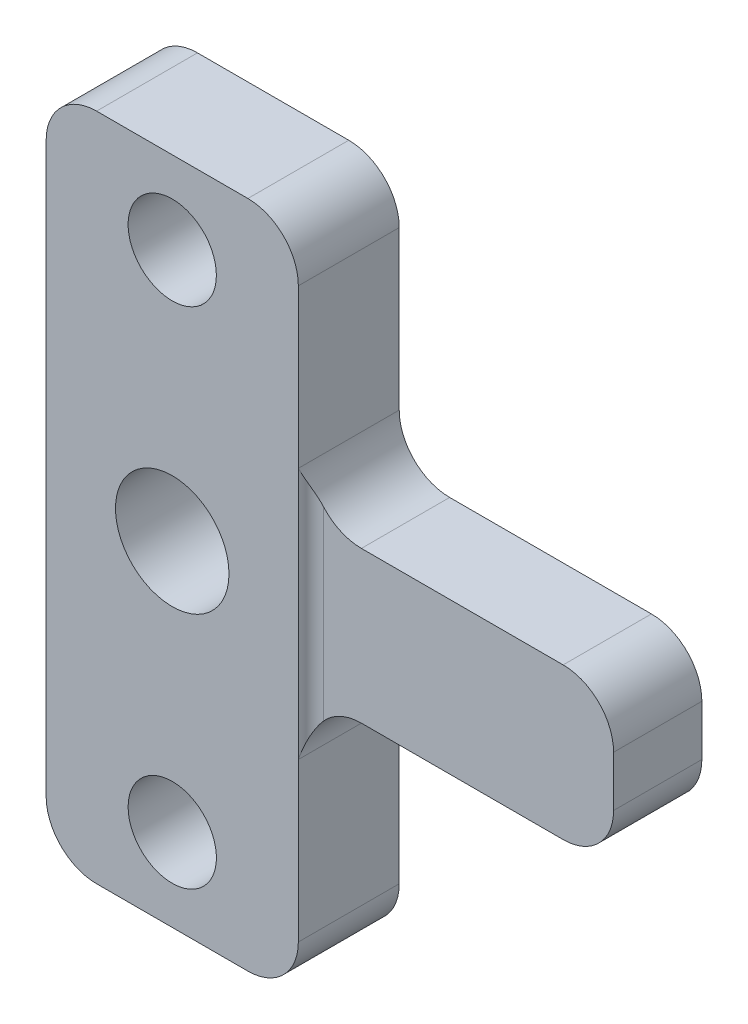
ISO-10303-21;
HEADER;
FILE_DESCRIPTION(('STEP AP214'),'2;1');
FILE_NAME('part.step','',(''),(''),'','','');
FILE_SCHEMA(('AUTOMOTIVE_DESIGN { 1 0 10303 214 1 1 1 1 }'));
ENDSEC;
DATA;
#1=APPLICATION_CONTEXT('core data for automotive mechanical design processes');
#2=APPLICATION_PROTOCOL_DEFINITION('international standard','automotive_design',2000,#1);
#3=PRODUCT_CONTEXT('',#1,'mechanical');
#4=PRODUCT('Part','Part','',(#3));
#5=PRODUCT_RELATED_PRODUCT_CATEGORY('part','',(#4));
#6=PRODUCT_DEFINITION_FORMATION('','',#4);
#7=PRODUCT_DEFINITION_CONTEXT('part definition',#1,'design');
#8=PRODUCT_DEFINITION('design','',#6,#7);
#9=PRODUCT_DEFINITION_SHAPE('','',#8);
#10=(LENGTH_UNIT() NAMED_UNIT(*) SI_UNIT(.MILLI.,.METRE.));
#11=(NAMED_UNIT(*) PLANE_ANGLE_UNIT() SI_UNIT($,.RADIAN.));
#12=(NAMED_UNIT(*) SI_UNIT($,.STERADIAN.) SOLID_ANGLE_UNIT());
#13=UNCERTAINTY_MEASURE_WITH_UNIT(LENGTH_MEASURE(1.E-05),#10,'distance_accuracy_value','');
#14=(GEOMETRIC_REPRESENTATION_CONTEXT(3) GLOBAL_UNCERTAINTY_ASSIGNED_CONTEXT((#13)) GLOBAL_UNIT_ASSIGNED_CONTEXT((#10,
#11,#12)) REPRESENTATION_CONTEXT('',''));
#15=CARTESIAN_POINT('',(0.,0.,0.));
#16=DIRECTION('',(0.,0.,1.));
#17=DIRECTION('',(1.,0.,0.));
#18=AXIS2_PLACEMENT_3D('',#15,#16,#17);
#19=CARTESIAN_POINT('',(43.5,0.,4.));
#20=DIRECTION('',(0.,1.,0.));
#21=DIRECTION('',(-1.,0.,0.));
#22=AXIS2_PLACEMENT_3D('',#19,#20,#21);
#23=CYLINDRICAL_SURFACE('',#22,0.5);
#24=DIRECTION('',(0.,-1.,0.));
#25=VECTOR('',#24,1.);
#26=CARTESIAN_POINT('',(43.5,0.,3.5));
#27=LINE('',#26,#25);
#28=CARTESIAN_POINT('',(43.5,3.6771243444677,3.5));
#29=VERTEX_POINT('',#28);
#30=CARTESIAN_POINT('',(43.5,-3.67712434446772,3.5));
#31=VERTEX_POINT('',#30);
#32=EDGE_CURVE('E261',#29,#31,#27,.T.);
#33=ORIENTED_EDGE('',*,*,#32,.F.);
#34=CARTESIAN_POINT('',(43.5,3.6771243444677,3.5));
#35=CARTESIAN_POINT('',(43.478456447429,3.70154724580707,3.50001041146748));
#36=CARTESIAN_POINT('',(43.4575425858173,3.72646938363218,3.50139028328963));
#37=CARTESIAN_POINT('',(43.417098009736,3.77710745334594,3.5064983243941));
#38=CARTESIAN_POINT('',(43.397564719702,3.80282177131216,3.51022198524381));
#39=CARTESIAN_POINT('',(43.3414150034293,3.88055504003525,3.52425533247648));
#40=CARTESIAN_POINT('',(43.3068866264115,3.93357719270997,3.53744074350752));
#41=CARTESIAN_POINT('',(43.2506386728912,4.02937730299059,3.56574389704177));
#42=CARTESIAN_POINT('',(43.2277749505332,4.07182850550373,3.57978997791444));
#43=CARTESIAN_POINT('',(43.1854730364308,4.15751907346779,3.61044334270584));
#44=CARTESIAN_POINT('',(43.1660362607877,4.20075875663314,3.6270516801234));
#45=CARTESIAN_POINT('',(43.1125802028338,4.33174102610251,3.67994999938824));
#46=CARTESIAN_POINT('',(43.083621786334,4.42038913114452,3.71919775960539));
#47=CARTESIAN_POINT('',(43.0408438347057,4.5894983929953,3.7976213981519));
#48=CARTESIAN_POINT('',(43.025763474722,4.6698526292856,3.8363806074269));
#49=CARTESIAN_POINT('',(43.0055240776471,4.83082622741695,3.91543353741805));
#50=CARTESIAN_POINT('',(43.0003381027166,4.91144426909452,3.95572278625684));
#51=CARTESIAN_POINT('',(43.0000053371165,4.99466673224143,3.99733336930474));
#52=CARTESIAN_POINT('',(43.0000000044267,4.99733340577314,3.99866670626964));
#53=CARTESIAN_POINT('',(43.,5.,4.));
#54=B_SPLINE_CURVE_WITH_KNOTS('',3,(#34,#35,#36,#37,#38,#39,#40,#41,#42,#43,#44,#45,#46,#47,#48,
#49,#50,#51,#52,#53),.UNSPECIFIED.,.F.,.F.,(4,2,2,2,2,2,2,2,2,4),(0.,0.0975966634311048,
0.195006164580395,0.388196470326693,0.538676093841842,0.68921775435282,0.991572844675024,
1.26249642313566,1.53268134341627,1.54162562963826),.UNSPECIFIED.);
#55=CARTESIAN_POINT('',(43.,5.,4.));
#56=VERTEX_POINT('',#55);
#57=EDGE_CURVE('E264',#29,#56,#54,.T.);
#58=ORIENTED_EDGE('',*,*,#57,.T.);
#59=DIRECTION('',(0.,1.,0.));
#60=VECTOR('',#59,1.);
#61=CARTESIAN_POINT('',(43.,13.2664991614216,4.));
#62=LINE('',#61,#60);
#63=CARTESIAN_POINT('',(43.,-5.,4.));
#64=VERTEX_POINT('',#63);
#65=EDGE_CURVE('E212',#64,#56,#62,.T.);
#66=ORIENTED_EDGE('',*,*,#65,.F.);
#67=CARTESIAN_POINT('',(43.5,-3.67712434446772,3.5));
#68=CARTESIAN_POINT('',(43.478456447429,-3.70154724580711,3.50001041146748));
#69=CARTESIAN_POINT('',(43.4575425858172,-3.72646938363223,3.50139028328964));
#70=CARTESIAN_POINT('',(43.4170980097359,-3.77710745334604,3.50649832439411));
#71=CARTESIAN_POINT('',(43.3975647197019,-3.80282177131229,3.51022198524383));
#72=CARTESIAN_POINT('',(43.3414150034293,-3.88055504003536,3.52425533247651));
#73=CARTESIAN_POINT('',(43.3068866264114,-3.93357719271003,3.53744074350754));
#74=CARTESIAN_POINT('',(43.2506386728912,-4.02937730299058,3.56574389704176));
#75=CARTESIAN_POINT('',(43.2277749505333,-4.07182850550372,3.57978997791442));
#76=CARTESIAN_POINT('',(43.1854730364309,-4.15751907346773,3.61044334270582));
#77=CARTESIAN_POINT('',(43.1660362607877,-4.20075875663306,3.6270516801234));
#78=CARTESIAN_POINT('',(43.1125802028338,-4.3317410261025,3.67994999938815));
#79=CARTESIAN_POINT('',(43.083621786334,-4.4203891311447,3.719197759605));
#80=CARTESIAN_POINT('',(43.0408438347057,-4.58949839299516,3.79762139815224));
#81=CARTESIAN_POINT('',(43.025763474722,-4.66985262928502,3.83638060742814));
#82=CARTESIAN_POINT('',(43.0055240776472,-4.8308262274176,3.91543353741682));
#83=CARTESIAN_POINT('',(43.0003381027167,-4.91144426909683,3.95572278625225));
#84=CARTESIAN_POINT('',(43.0000053371165,-4.99466673224158,3.99733336930443));
#85=CARTESIAN_POINT('',(43.0000000044267,-4.99733340577322,3.99866670626949));
#86=CARTESIAN_POINT('',(43.,-5.,4.));
#87=B_SPLINE_CURVE_WITH_KNOTS('',3,(#67,#68,#69,#70,#71,#72,#73,#74,#75,#76,#77,#78,#79,#80,#81,
#82,#83,#84,#85,#86),.UNSPECIFIED.,.F.,.F.,(4,2,2,2,2,2,2,2,2,4),(0.,0.0975966634311902,
0.195006164580567,0.388196470326694,0.538676093841775,0.689217754352708,0.991572844675035,
1.26249642313569,1.53268134341626,1.54162562963825),.UNSPECIFIED.);
#88=EDGE_CURVE('E273',#64,#31,#87,.F.);
#89=ORIENTED_EDGE('',*,*,#88,.T.);
#90=EDGE_LOOP('',(#33,#58,#66,#89));
#91=FACE_BOUND('',#90,.T.);
#92=ADVANCED_FACE('F33',(#91),#23,.F.);
#93=CARTESIAN_POINT('',(43.,13.2664991614216,4.));
#94=DIRECTION('',(-1.,0.,0.));
#95=DIRECTION('',(0.,-1.,0.));
#96=AXIS2_PLACEMENT_3D('',#93,#94,#95);
#97=PLANE('',#96);
#98=DIRECTION('',(0.,1.,0.));
#99=VECTOR('',#98,1.);
#100=CARTESIAN_POINT('',(43.,13.2664991614216,0.));
#101=LINE('',#100,#99);
#102=CARTESIAN_POINT('',(43.,5.,0.));
#103=VERTEX_POINT('',#102);
#104=CARTESIAN_POINT('',(43.,11.2664991614216,0.));
#105=VERTEX_POINT('',#104);
#106=EDGE_CURVE('E206',#103,#105,#101,.T.);
#107=ORIENTED_EDGE('',*,*,#106,.T.);
#108=DIRECTION('',(0.,0.,-1.));
#109=VECTOR('',#108,1.);
#110=CARTESIAN_POINT('',(43.,11.2664991614216,4.));
#111=LINE('',#110,#109);
#112=CARTESIAN_POINT('',(43.,11.2664991614216,4.));
#113=VERTEX_POINT('',#112);
#114=EDGE_CURVE('E11',#105,#113,#111,.F.);
#115=ORIENTED_EDGE('',*,*,#114,.T.);
#116=EDGE_CURVE('E213',#56,#113,#62,.T.);
#117=ORIENTED_EDGE('',*,*,#116,.F.);
#118=DIRECTION('',(0.,0.,-1.));
#119=VECTOR('',#118,1.);
#120=CARTESIAN_POINT('',(43.,5.,0.));
#121=LINE('',#120,#119);
#122=EDGE_CURVE('E243',#56,#103,#121,.T.);
#123=ORIENTED_EDGE('',*,*,#122,.T.);
#124=EDGE_LOOP('',(#107,#115,#117,#123));
#125=FACE_BOUND('',#124,.T.);
#126=ADVANCED_FACE('F303',(#125),#97,.F.);
#127=CARTESIAN_POINT('',(43.,-11.2664991614216,4.));
#128=VERTEX_POINT('',#127);
#129=EDGE_CURVE('E209',#128,#64,#62,.T.);
#130=ORIENTED_EDGE('',*,*,#129,.F.);
#131=DIRECTION('',(0.,0.,-1.));
#132=VECTOR('',#131,1.);
#133=CARTESIAN_POINT('',(43.,-11.2664991614216,4.));
#134=LINE('',#133,#132);
#135=CARTESIAN_POINT('',(43.,-11.2664991614216,0.));
#136=VERTEX_POINT('',#135);
#137=EDGE_CURVE('E374',#128,#136,#134,.T.);
#138=ORIENTED_EDGE('',*,*,#137,.T.);
#139=CARTESIAN_POINT('',(43.,-5.,0.));
#140=VERTEX_POINT('',#139);
#141=EDGE_CURVE('E220',#136,#140,#101,.T.);
#142=ORIENTED_EDGE('',*,*,#141,.T.);
#143=DIRECTION('',(0.,0.,-1.));
#144=VECTOR('',#143,1.);
#145=CARTESIAN_POINT('',(43.,-5.00000000000001,3.5));
#146=LINE('',#145,#144);
#147=EDGE_CURVE('E246',#140,#64,#146,.F.);
#148=ORIENTED_EDGE('',*,*,#147,.T.);
#149=EDGE_LOOP('',(#130,#138,#142,#148));
#150=FACE_BOUND('',#149,.T.);
#151=ADVANCED_FACE('F299',(#150),#97,.F.);
#152=CARTESIAN_POINT('',(0.,0.,4.));
#153=DIRECTION('',(0.,0.,1.));
#154=DIRECTION('',(1.,0.,0.));
#155=AXIS2_PLACEMENT_3D('',#152,#153,#154);
#156=PLANE('',#155);
#157=CARTESIAN_POINT('',(38.,10.,4.));
#158=DIRECTION('',(0.,0.,1.));
#159=DIRECTION('',(1.,0.,0.));
#160=AXIS2_PLACEMENT_3D('',#157,#158,#159);
#161=CIRCLE('',#160,1.75);
#162=CARTESIAN_POINT('',(39.75,10.,4.));
#163=VERTEX_POINT('',#162);
#164=EDGE_CURVE('E197',#163,#163,#161,.T.);
#165=ORIENTED_EDGE('',*,*,#164,.F.);
#166=EDGE_LOOP('',(#165));
#167=FACE_BOUND('',#166,.T.);
#168=DIRECTION('',(1.,0.,0.));
#169=VECTOR('',#168,1.);
#170=CARTESIAN_POINT('',(33.,-13.2664991614216,4.));
#171=LINE('',#170,#169);
#172=CARTESIAN_POINT('',(35.,-13.2664991614216,4.));
#173=VERTEX_POINT('',#172);
#174=CARTESIAN_POINT('',(41.,-13.2664991614216,4.));
#175=VERTEX_POINT('',#174);
#176=EDGE_CURVE('E217',#173,#175,#171,.T.);
#177=ORIENTED_EDGE('',*,*,#176,.T.);
#178=CARTESIAN_POINT('',(41.,-11.2664991614216,4.));
#179=DIRECTION('',(0.,0.,1.));
#180=DIRECTION('',(1.,0.,0.));
#181=AXIS2_PLACEMENT_3D('',#178,#179,#180);
#182=CIRCLE('',#181,2.);
#183=EDGE_CURVE('E393',#175,#128,#182,.T.);
#184=ORIENTED_EDGE('',*,*,#183,.T.);
#185=ORIENTED_EDGE('',*,*,#129,.T.);
#186=ORIENTED_EDGE('',*,*,#65,.T.);
#187=ORIENTED_EDGE('',*,*,#116,.T.);
#188=CARTESIAN_POINT('',(41.,11.2664991614216,4.));
#189=DIRECTION('',(0.,0.,1.));
#190=DIRECTION('',(1.,0.,0.));
#191=AXIS2_PLACEMENT_3D('',#188,#189,#190);
#192=CIRCLE('',#191,2.);
#193=CARTESIAN_POINT('',(41.,13.2664991614216,4.));
#194=VERTEX_POINT('',#193);
#195=EDGE_CURVE('E388',#113,#194,#192,.T.);
#196=ORIENTED_EDGE('',*,*,#195,.T.);
#197=DIRECTION('',(-1.,0.,0.));
#198=VECTOR('',#197,1.);
#199=CARTESIAN_POINT('',(33.,13.2664991614216,4.));
#200=LINE('',#199,#198);
#201=CARTESIAN_POINT('',(35.,13.2664991614216,4.));
#202=VERTEX_POINT('',#201);
#203=EDGE_CURVE('E211',#194,#202,#200,.T.);
#204=ORIENTED_EDGE('',*,*,#203,.T.);
#205=CARTESIAN_POINT('',(35.,11.2664991614216,4.));
#206=DIRECTION('',(0.,0.,1.));
#207=DIRECTION('',(1.,0.,0.));
#208=AXIS2_PLACEMENT_3D('',#205,#206,#207);
#209=CIRCLE('',#208,2.);
#210=CARTESIAN_POINT('',(33.,11.2664991614216,4.));
#211=VERTEX_POINT('',#210);
#212=EDGE_CURVE('E55',#202,#211,#209,.T.);
#213=ORIENTED_EDGE('',*,*,#212,.T.);
#214=DIRECTION('',(0.,-1.,0.));
#215=VECTOR('',#214,1.);
#216=CARTESIAN_POINT('',(33.,13.2664991614216,4.));
#217=LINE('',#216,#215);
#218=CARTESIAN_POINT('',(33.,-11.2664991614216,4.));
#219=VERTEX_POINT('',#218);
#220=EDGE_CURVE('E215',#211,#219,#217,.T.);
#221=ORIENTED_EDGE('',*,*,#220,.T.);
#222=CARTESIAN_POINT('',(35.,-11.2664991614216,4.));
#223=DIRECTION('',(0.,0.,1.));
#224=DIRECTION('',(1.,0.,0.));
#225=AXIS2_PLACEMENT_3D('',#222,#223,#224);
#226=CIRCLE('',#225,2.);
#227=EDGE_CURVE('E391',#219,#173,#226,.T.);
#228=ORIENTED_EDGE('',*,*,#227,.T.);
#229=EDGE_LOOP('',(#177,#184,#185,#186,#187,#196,#204,#213,#221,#228));
#230=FACE_BOUND('',#229,.T.);
#231=CARTESIAN_POINT('',(38.,0.,4.));
#232=DIRECTION('',(0.,0.,1.));
#233=DIRECTION('',(1.,0.,0.));
#234=AXIS2_PLACEMENT_3D('',#231,#232,#233);
#235=CIRCLE('',#234,2.25);
#236=CARTESIAN_POINT('',(40.25,0.,4.));
#237=VERTEX_POINT('',#236);
#238=EDGE_CURVE('E203',#237,#237,#235,.T.);
#239=ORIENTED_EDGE('',*,*,#238,.F.);
#240=EDGE_LOOP('',(#239));
#241=FACE_BOUND('',#240,.T.);
#242=CARTESIAN_POINT('',(38.,-10.,4.));
#243=DIRECTION('',(0.,0.,1.));
#244=DIRECTION('',(-1.,0.,0.));
#245=AXIS2_PLACEMENT_3D('',#242,#243,#244);
#246=CIRCLE('',#245,1.75);
#247=CARTESIAN_POINT('',(36.25,-10.,4.));
#248=VERTEX_POINT('',#247);
#249=EDGE_CURVE('E190',#248,#248,#246,.T.);
#250=ORIENTED_EDGE('',*,*,#249,.F.);
#251=EDGE_LOOP('',(#250));
#252=FACE_BOUND('',#251,.T.);
#253=ADVANCED_FACE('F302',(#167,#230,#241,#252),#156,.T.);
#254=CARTESIAN_POINT('',(0.,0.,0.));
#255=DIRECTION('',(0.,0.,1.));
#256=DIRECTION('',(1.,0.,0.));
#257=AXIS2_PLACEMENT_3D('',#254,#255,#256);
#258=PLANE('',#257);
#259=ORIENTED_EDGE('',*,*,#141,.F.);
#260=CARTESIAN_POINT('',(41.,-11.2664991614216,0.));
#261=DIRECTION('',(0.,0.,1.));
#262=DIRECTION('',(1.,0.,0.));
#263=AXIS2_PLACEMENT_3D('',#260,#261,#262);
#264=CIRCLE('',#263,2.);
#265=CARTESIAN_POINT('',(41.,-13.2664991614216,0.));
#266=VERTEX_POINT('',#265);
#267=EDGE_CURVE('E381',#136,#266,#264,.F.);
#268=ORIENTED_EDGE('',*,*,#267,.T.);
#269=DIRECTION('',(1.,0.,0.));
#270=VECTOR('',#269,1.);
#271=CARTESIAN_POINT('',(33.,-13.2664991614216,0.));
#272=LINE('',#271,#270);
#273=CARTESIAN_POINT('',(35.,-13.2664991614216,0.));
#274=VERTEX_POINT('',#273);
#275=EDGE_CURVE('E227',#274,#266,#272,.T.);
#276=ORIENTED_EDGE('',*,*,#275,.F.);
#277=CARTESIAN_POINT('',(35.,-11.2664991614216,0.));
#278=DIRECTION('',(0.,0.,1.));
#279=DIRECTION('',(1.,0.,0.));
#280=AXIS2_PLACEMENT_3D('',#277,#278,#279);
#281=CIRCLE('',#280,2.);
#282=CARTESIAN_POINT('',(33.,-11.2664991614216,0.));
#283=VERTEX_POINT('',#282);
#284=EDGE_CURVE('E376',#274,#283,#281,.F.);
#285=ORIENTED_EDGE('',*,*,#284,.T.);
#286=DIRECTION('',(0.,-1.,0.));
#287=VECTOR('',#286,1.);
#288=CARTESIAN_POINT('',(33.,13.2664991614216,0.));
#289=LINE('',#288,#287);
#290=CARTESIAN_POINT('',(33.,11.2664991614216,0.));
#291=VERTEX_POINT('',#290);
#292=EDGE_CURVE('E225',#291,#283,#289,.T.);
#293=ORIENTED_EDGE('',*,*,#292,.F.);
#294=CARTESIAN_POINT('',(35.,11.2664991614216,0.));
#295=DIRECTION('',(0.,0.,1.));
#296=DIRECTION('',(1.,0.,0.));
#297=AXIS2_PLACEMENT_3D('',#294,#295,#296);
#298=CIRCLE('',#297,2.);
#299=CARTESIAN_POINT('',(35.,13.2664991614216,0.));
#300=VERTEX_POINT('',#299);
#301=EDGE_CURVE('E373',#291,#300,#298,.F.);
#302=ORIENTED_EDGE('',*,*,#301,.T.);
#303=DIRECTION('',(-1.,0.,0.));
#304=VECTOR('',#303,1.);
#305=CARTESIAN_POINT('',(33.,13.2664991614216,0.));
#306=LINE('',#305,#304);
#307=CARTESIAN_POINT('',(41.,13.2664991614216,0.));
#308=VERTEX_POINT('',#307);
#309=EDGE_CURVE('E222',#308,#300,#306,.T.);
#310=ORIENTED_EDGE('',*,*,#309,.F.);
#311=CARTESIAN_POINT('',(41.,11.2664991614216,0.));
#312=DIRECTION('',(0.,0.,1.));
#313=DIRECTION('',(1.,0.,0.));
#314=AXIS2_PLACEMENT_3D('',#311,#312,#313);
#315=CIRCLE('',#314,2.);
#316=EDGE_CURVE('E369',#308,#105,#315,.F.);
#317=ORIENTED_EDGE('',*,*,#316,.T.);
#318=ORIENTED_EDGE('',*,*,#106,.F.);
#319=CARTESIAN_POINT('',(45.,5.,0.));
#320=DIRECTION('',(0.,0.,1.));
#321=DIRECTION('',(1.,0.,0.));
#322=AXIS2_PLACEMENT_3D('',#319,#320,#321);
#323=CIRCLE('',#322,2.);
#324=CARTESIAN_POINT('',(45.,3.,0.));
#325=VERTEX_POINT('',#324);
#326=EDGE_CURVE('E256',#103,#325,#323,.T.);
#327=ORIENTED_EDGE('',*,*,#326,.T.);
#328=DIRECTION('',(-1.,0.,0.));
#329=VECTOR('',#328,1.);
#330=CARTESIAN_POINT('',(55.,3.,0.));
#331=LINE('',#330,#329);
#332=CARTESIAN_POINT('',(53.,3.,0.));
#333=VERTEX_POINT('',#332);
#334=EDGE_CURVE('E180',#333,#325,#331,.T.);
#335=ORIENTED_EDGE('',*,*,#334,.F.);
#336=CARTESIAN_POINT('',(53.,1.,0.));
#337=DIRECTION('',(0.,0.,1.));
#338=DIRECTION('',(1.,0.,0.));
#339=AXIS2_PLACEMENT_3D('',#336,#337,#338);
#340=CIRCLE('',#339,2.);
#341=CARTESIAN_POINT('',(55.,1.,0.));
#342=VERTEX_POINT('',#341);
#343=EDGE_CURVE('E164',#333,#342,#340,.F.);
#344=ORIENTED_EDGE('',*,*,#343,.T.);
#345=DIRECTION('',(0.,1.,0.));
#346=VECTOR('',#345,1.);
#347=CARTESIAN_POINT('',(55.,3.,0.));
#348=LINE('',#347,#346);
#349=CARTESIAN_POINT('',(55.,-1.,0.));
#350=VERTEX_POINT('',#349);
#351=EDGE_CURVE('E170',#350,#342,#348,.T.);
#352=ORIENTED_EDGE('',*,*,#351,.F.);
#353=CARTESIAN_POINT('',(53.,-1.,0.));
#354=DIRECTION('',(0.,0.,1.));
#355=DIRECTION('',(1.,0.,0.));
#356=AXIS2_PLACEMENT_3D('',#353,#354,#355);
#357=CIRCLE('',#356,2.);
#358=CARTESIAN_POINT('',(53.,-3.,0.));
#359=VERTEX_POINT('',#358);
#360=EDGE_CURVE('E154',#350,#359,#357,.F.);
#361=ORIENTED_EDGE('',*,*,#360,.T.);
#362=DIRECTION('',(1.,0.,0.));
#363=VECTOR('',#362,1.);
#364=CARTESIAN_POINT('',(55.,-3.,0.));
#365=LINE('',#364,#363);
#366=CARTESIAN_POINT('',(45.,-3.00000000000001,0.));
#367=VERTEX_POINT('',#366);
#368=EDGE_CURVE('E183',#367,#359,#365,.T.);
#369=ORIENTED_EDGE('',*,*,#368,.F.);
#370=CARTESIAN_POINT('',(45.,-5.,0.));
#371=DIRECTION('',(0.,0.,1.));
#372=DIRECTION('',(1.,0.,0.));
#373=AXIS2_PLACEMENT_3D('',#370,#371,#372);
#374=CIRCLE('',#373,2.);
#375=EDGE_CURVE('E251',#367,#140,#374,.T.);
#376=ORIENTED_EDGE('',*,*,#375,.T.);
#377=EDGE_LOOP('',(#259,#268,#276,#285,#293,#302,#310,#317,#318,#327,#335,#344,#352,#361,#369,#376));
#378=FACE_BOUND('',#377,.T.);
#379=CARTESIAN_POINT('',(38.,0.,0.));
#380=DIRECTION('',(0.,0.,1.));
#381=DIRECTION('',(1.,0.,0.));
#382=AXIS2_PLACEMENT_3D('',#379,#380,#381);
#383=CIRCLE('',#382,2.25);
#384=CARTESIAN_POINT('',(40.25,0.,0.));
#385=VERTEX_POINT('',#384);
#386=EDGE_CURVE('E200',#385,#385,#383,.T.);
#387=ORIENTED_EDGE('',*,*,#386,.T.);
#388=EDGE_LOOP('',(#387));
#389=FACE_BOUND('',#388,.T.);
#390=CARTESIAN_POINT('',(38.,10.,0.));
#391=DIRECTION('',(0.,0.,1.));
#392=DIRECTION('',(1.,0.,0.));
#393=AXIS2_PLACEMENT_3D('',#390,#391,#392);
#394=CIRCLE('',#393,1.75);
#395=CARTESIAN_POINT('',(39.75,10.,0.));
#396=VERTEX_POINT('',#395);
#397=EDGE_CURVE('E193',#396,#396,#394,.T.);
#398=ORIENTED_EDGE('',*,*,#397,.T.);
#399=EDGE_LOOP('',(#398));
#400=FACE_BOUND('',#399,.T.);
#401=CARTESIAN_POINT('',(38.,-10.,0.));
#402=DIRECTION('',(0.,0.,1.));
#403=DIRECTION('',(-1.,0.,0.));
#404=AXIS2_PLACEMENT_3D('',#401,#402,#403);
#405=CIRCLE('',#404,1.75);
#406=CARTESIAN_POINT('',(36.25,-10.,0.));
#407=VERTEX_POINT('',#406);
#408=EDGE_CURVE('E194',#407,#407,#405,.T.);
#409=ORIENTED_EDGE('',*,*,#408,.T.);
#410=EDGE_LOOP('',(#409));
#411=FACE_BOUND('',#410,.T.);
#412=ADVANCED_FACE('F177',(#378,#389,#400,#411),#258,.F.);
#413=CARTESIAN_POINT('',(33.,13.2664991614216,4.));
#414=DIRECTION('',(0.,-1.,0.));
#415=DIRECTION('',(1.,0.,0.));
#416=AXIS2_PLACEMENT_3D('',#413,#414,#415);
#417=PLANE('',#416);
#418=ORIENTED_EDGE('',*,*,#309,.T.);
#419=DIRECTION('',(0.,0.,-1.));
#420=VECTOR('',#419,1.);
#421=CARTESIAN_POINT('',(35.,13.2664991614216,4.));
#422=LINE('',#421,#420);
#423=EDGE_CURVE('E41',#300,#202,#422,.F.);
#424=ORIENTED_EDGE('',*,*,#423,.T.);
#425=ORIENTED_EDGE('',*,*,#203,.F.);
#426=DIRECTION('',(0.,0.,-1.));
#427=VECTOR('',#426,1.);
#428=CARTESIAN_POINT('',(41.,13.2664991614216,4.));
#429=LINE('',#428,#427);
#430=EDGE_CURVE('E399',#194,#308,#429,.T.);
#431=ORIENTED_EDGE('',*,*,#430,.T.);
#432=EDGE_LOOP('',(#418,#424,#425,#431));
#433=FACE_BOUND('',#432,.T.);
#434=ADVANCED_FACE('F305',(#433),#417,.F.);
#435=CARTESIAN_POINT('',(33.,13.2664991614216,4.));
#436=DIRECTION('',(1.,0.,0.));
#437=DIRECTION('',(0.,0.,-1.));
#438=AXIS2_PLACEMENT_3D('',#435,#436,#437);
#439=PLANE('',#438);
#440=ORIENTED_EDGE('',*,*,#292,.T.);
#441=DIRECTION('',(0.,0.,-1.));
#442=VECTOR('',#441,1.);
#443=CARTESIAN_POINT('',(33.,-11.2664991614216,4.));
#444=LINE('',#443,#442);
#445=EDGE_CURVE('E48',#283,#219,#444,.F.);
#446=ORIENTED_EDGE('',*,*,#445,.T.);
#447=ORIENTED_EDGE('',*,*,#220,.F.);
#448=DIRECTION('',(0.,0.,-1.));
#449=VECTOR('',#448,1.);
#450=CARTESIAN_POINT('',(33.,11.2664991614216,4.));
#451=LINE('',#450,#449);
#452=EDGE_CURVE('E395',#211,#291,#451,.T.);
#453=ORIENTED_EDGE('',*,*,#452,.T.);
#454=EDGE_LOOP('',(#440,#446,#447,#453));
#455=FACE_BOUND('',#454,.T.);
#456=ADVANCED_FACE('F308',(#455),#439,.F.);
#457=CARTESIAN_POINT('',(33.,-13.2664991614216,4.));
#458=DIRECTION('',(0.,1.,0.));
#459=DIRECTION('',(-1.,0.,0.));
#460=AXIS2_PLACEMENT_3D('',#457,#458,#459);
#461=PLANE('',#460);
#462=ORIENTED_EDGE('',*,*,#275,.T.);
#463=DIRECTION('',(0.,0.,-1.));
#464=VECTOR('',#463,1.);
#465=CARTESIAN_POINT('',(41.,-13.2664991614216,4.));
#466=LINE('',#465,#464);
#467=EDGE_CURVE('E386',#266,#175,#466,.F.);
#468=ORIENTED_EDGE('',*,*,#467,.T.);
#469=ORIENTED_EDGE('',*,*,#176,.F.);
#470=DIRECTION('',(0.,0.,-1.));
#471=VECTOR('',#470,1.);
#472=CARTESIAN_POINT('',(35.,-13.2664991614216,4.));
#473=LINE('',#472,#471);
#474=EDGE_CURVE('E383',#173,#274,#473,.T.);
#475=ORIENTED_EDGE('',*,*,#474,.T.);
#476=EDGE_LOOP('',(#462,#468,#469,#475));
#477=FACE_BOUND('',#476,.T.);
#478=ADVANCED_FACE('F312',(#477),#461,.F.);
#479=CARTESIAN_POINT('',(38.,0.,4.));
#480=DIRECTION('',(0.,0.,-1.));
#481=DIRECTION('',(-1.,0.,0.));
#482=AXIS2_PLACEMENT_3D('',#479,#480,#481);
#483=CYLINDRICAL_SURFACE('',#482,2.25);
#484=ORIENTED_EDGE('',*,*,#238,.T.);
#485=EDGE_LOOP('',(#484));
#486=FACE_BOUND('',#485,.T.);
#487=ORIENTED_EDGE('',*,*,#386,.F.);
#488=EDGE_LOOP('',(#487));
#489=FACE_BOUND('',#488,.T.);
#490=ADVANCED_FACE('F315',(#486,#489),#483,.F.);
#491=CARTESIAN_POINT('',(38.,10.,4.));
#492=DIRECTION('',(0.,0.,-1.));
#493=DIRECTION('',(-1.,0.,0.));
#494=AXIS2_PLACEMENT_3D('',#491,#492,#493);
#495=CYLINDRICAL_SURFACE('',#494,1.75);
#496=ORIENTED_EDGE('',*,*,#164,.T.);
#497=EDGE_LOOP('',(#496));
#498=FACE_BOUND('',#497,.T.);
#499=ORIENTED_EDGE('',*,*,#397,.F.);
#500=EDGE_LOOP('',(#499));
#501=FACE_BOUND('',#500,.T.);
#502=ADVANCED_FACE('F324',(#498,#501),#495,.F.);
#503=CARTESIAN_POINT('',(38.,-10.,4.));
#504=DIRECTION('',(0.,0.,-1.));
#505=DIRECTION('',(-1.,0.,0.));
#506=AXIS2_PLACEMENT_3D('',#503,#504,#505);
#507=CYLINDRICAL_SURFACE('',#506,1.75);
#508=ORIENTED_EDGE('',*,*,#249,.T.);
#509=EDGE_LOOP('',(#508));
#510=FACE_BOUND('',#509,.T.);
#511=ORIENTED_EDGE('',*,*,#408,.F.);
#512=EDGE_LOOP('',(#511));
#513=FACE_BOUND('',#512,.T.);
#514=ADVANCED_FACE('F328',(#510,#513),#507,.F.);
#515=CARTESIAN_POINT('',(55.,3.,3.5));
#516=DIRECTION('',(-1.,0.,0.));
#517=DIRECTION('',(0.,0.,1.));
#518=AXIS2_PLACEMENT_3D('',#515,#516,#517);
#519=PLANE('',#518);
#520=DIRECTION('',(0.,1.,0.));
#521=VECTOR('',#520,1.);
#522=CARTESIAN_POINT('',(55.,3.,3.5));
#523=LINE('',#522,#521);
#524=CARTESIAN_POINT('',(55.,-1.,3.5));
#525=VERTEX_POINT('',#524);
#526=CARTESIAN_POINT('',(55.,1.,3.5));
#527=VERTEX_POINT('',#526);
#528=EDGE_CURVE('E173',#525,#527,#523,.T.);
#529=ORIENTED_EDGE('',*,*,#528,.F.);
#530=DIRECTION('',(0.,0.,-1.));
#531=VECTOR('',#530,1.);
#532=CARTESIAN_POINT('',(55.,-1.,3.5));
#533=LINE('',#532,#531);
#534=EDGE_CURVE('E158',#525,#350,#533,.T.);
#535=ORIENTED_EDGE('',*,*,#534,.T.);
#536=ORIENTED_EDGE('',*,*,#351,.T.);
#537=DIRECTION('',(0.,0.,-1.));
#538=VECTOR('',#537,1.);
#539=CARTESIAN_POINT('',(55.,1.,3.5));
#540=LINE('',#539,#538);
#541=EDGE_CURVE('E174',#342,#527,#540,.F.);
#542=ORIENTED_EDGE('',*,*,#541,.T.);
#543=EDGE_LOOP('',(#529,#535,#536,#542));
#544=FACE_BOUND('',#543,.T.);
#545=ADVANCED_FACE('F169',(#544),#519,.F.);
#546=CARTESIAN_POINT('',(55.,3.,3.5));
#547=DIRECTION('',(0.,-1.,0.));
#548=DIRECTION('',(1.,0.,0.));
#549=AXIS2_PLACEMENT_3D('',#546,#547,#548);
#550=PLANE('',#549);
#551=ORIENTED_EDGE('',*,*,#334,.T.);
#552=DIRECTION('',(0.,0.,-1.));
#553=VECTOR('',#552,1.);
#554=CARTESIAN_POINT('',(45.,3.,3.5));
#555=LINE('',#554,#553);
#556=CARTESIAN_POINT('',(45.,3.,3.5));
#557=VERTEX_POINT('',#556);
#558=EDGE_CURVE('E249',#325,#557,#555,.F.);
#559=ORIENTED_EDGE('',*,*,#558,.T.);
#560=DIRECTION('',(-1.,0.,0.));
#561=VECTOR('',#560,1.);
#562=CARTESIAN_POINT('',(55.,3.,3.5));
#563=LINE('',#562,#561);
#564=CARTESIAN_POINT('',(53.,3.,3.5));
#565=VERTEX_POINT('',#564);
#566=EDGE_CURVE('E361',#565,#557,#563,.T.);
#567=ORIENTED_EDGE('',*,*,#566,.F.);
#568=DIRECTION('',(0.,0.,-1.));
#569=VECTOR('',#568,1.);
#570=CARTESIAN_POINT('',(53.,3.,3.5));
#571=LINE('',#570,#569);
#572=EDGE_CURVE('E237',#565,#333,#571,.T.);
#573=ORIENTED_EDGE('',*,*,#572,.T.);
#574=EDGE_LOOP('',(#551,#559,#567,#573));
#575=FACE_BOUND('',#574,.T.);
#576=ADVANCED_FACE('F335',(#575),#550,.F.);
#577=CARTESIAN_POINT('',(55.,-3.,3.5));
#578=DIRECTION('',(0.,1.,0.));
#579=DIRECTION('',(-1.,0.,0.));
#580=AXIS2_PLACEMENT_3D('',#577,#578,#579);
#581=PLANE('',#580);
#582=DIRECTION('',(1.,0.,0.));
#583=VECTOR('',#582,1.);
#584=CARTESIAN_POINT('',(55.,-3.,3.5));
#585=LINE('',#584,#583);
#586=CARTESIAN_POINT('',(45.,-3.00000000000001,3.5));
#587=VERTEX_POINT('',#586);
#588=CARTESIAN_POINT('',(53.,-3.,3.5));
#589=VERTEX_POINT('',#588);
#590=EDGE_CURVE('E186',#587,#589,#585,.T.);
#591=ORIENTED_EDGE('',*,*,#590,.F.);
#592=DIRECTION('',(0.,0.,-1.));
#593=VECTOR('',#592,1.);
#594=CARTESIAN_POINT('',(45.,-3.00000000000001,0.));
#595=LINE('',#594,#593);
#596=EDGE_CURVE('E240',#587,#367,#595,.T.);
#597=ORIENTED_EDGE('',*,*,#596,.T.);
#598=ORIENTED_EDGE('',*,*,#368,.T.);
#599=DIRECTION('',(0.,0.,-1.));
#600=VECTOR('',#599,1.);
#601=CARTESIAN_POINT('',(53.,-3.,3.5));
#602=LINE('',#601,#600);
#603=EDGE_CURVE('E160',#359,#589,#602,.F.);
#604=ORIENTED_EDGE('',*,*,#603,.T.);
#605=EDGE_LOOP('',(#591,#597,#598,#604));
#606=FACE_BOUND('',#605,.T.);
#607=ADVANCED_FACE('F338',(#606),#581,.F.);
#608=CARTESIAN_POINT('',(0.,0.,3.5));
#609=DIRECTION('',(0.,0.,-1.));
#610=DIRECTION('',(-1.,0.,0.));
#611=AXIS2_PLACEMENT_3D('',#608,#609,#610);
#612=PLANE('',#611);
#613=CARTESIAN_POINT('',(45.,5.,3.5));
#614=DIRECTION('',(0.,0.,-1.));
#615=DIRECTION('',(-1.,0.,0.));
#616=AXIS2_PLACEMENT_3D('',#613,#614,#615);
#617=CIRCLE('',#616,2.);
#618=EDGE_CURVE('E258',#557,#29,#617,.T.);
#619=ORIENTED_EDGE('',*,*,#618,.T.);
#620=ORIENTED_EDGE('',*,*,#32,.T.);
#621=CARTESIAN_POINT('',(45.,-5.,3.5));
#622=DIRECTION('',(0.,0.,-1.));
#623=DIRECTION('',(-1.,0.,0.));
#624=AXIS2_PLACEMENT_3D('',#621,#622,#623);
#625=CIRCLE('',#624,2.);
#626=EDGE_CURVE('E254',#31,#587,#625,.T.);
#627=ORIENTED_EDGE('',*,*,#626,.T.);
#628=ORIENTED_EDGE('',*,*,#590,.T.);
#629=CARTESIAN_POINT('',(53.,-1.,3.5));
#630=DIRECTION('',(0.,0.,-1.));
#631=DIRECTION('',(-1.,0.,0.));
#632=AXIS2_PLACEMENT_3D('',#629,#630,#631);
#633=CIRCLE('',#632,2.);
#634=EDGE_CURVE('E235',#589,#525,#633,.F.);
#635=ORIENTED_EDGE('',*,*,#634,.T.);
#636=ORIENTED_EDGE('',*,*,#528,.T.);
#637=CARTESIAN_POINT('',(53.,1.,3.5));
#638=DIRECTION('',(0.,0.,-1.));
#639=DIRECTION('',(-1.,0.,0.));
#640=AXIS2_PLACEMENT_3D('',#637,#638,#639);
#641=CIRCLE('',#640,2.);
#642=EDGE_CURVE('E233',#527,#565,#641,.F.);
#643=ORIENTED_EDGE('',*,*,#642,.T.);
#644=ORIENTED_EDGE('',*,*,#566,.T.);
#645=EDGE_LOOP('',(#619,#620,#627,#628,#635,#636,#643,#644));
#646=FACE_BOUND('',#645,.T.);
#647=ADVANCED_FACE('F298',(#646),#612,.F.);
#648=CARTESIAN_POINT('',(53.,-1.,3.5));
#649=DIRECTION('',(0.,0.,-1.));
#650=DIRECTION('',(-1.,0.,0.));
#651=AXIS2_PLACEMENT_3D('',#648,#649,#650);
#652=CYLINDRICAL_SURFACE('',#651,2.);
#653=ORIENTED_EDGE('',*,*,#634,.F.);
#654=ORIENTED_EDGE('',*,*,#603,.F.);
#655=ORIENTED_EDGE('',*,*,#360,.F.);
#656=ORIENTED_EDGE('',*,*,#534,.F.);
#657=EDGE_LOOP('',(#653,#654,#655,#656));
#658=FACE_BOUND('',#657,.T.);
#659=ADVANCED_FACE('F157',(#658),#652,.T.);
#660=CARTESIAN_POINT('',(53.,1.,3.5));
#661=DIRECTION('',(0.,0.,-1.));
#662=DIRECTION('',(-1.,0.,0.));
#663=AXIS2_PLACEMENT_3D('',#660,#661,#662);
#664=CYLINDRICAL_SURFACE('',#663,2.);
#665=ORIENTED_EDGE('',*,*,#642,.F.);
#666=ORIENTED_EDGE('',*,*,#541,.F.);
#667=ORIENTED_EDGE('',*,*,#343,.F.);
#668=ORIENTED_EDGE('',*,*,#572,.F.);
#669=EDGE_LOOP('',(#665,#666,#667,#668));
#670=FACE_BOUND('',#669,.T.);
#671=ADVANCED_FACE('F291',(#670),#664,.T.);
#672=CARTESIAN_POINT('',(45.,-5.,3.5));
#673=DIRECTION('',(0.,0.,1.));
#674=DIRECTION('',(1.,0.,0.));
#675=AXIS2_PLACEMENT_3D('',#672,#673,#674);
#676=CYLINDRICAL_SURFACE('',#675,2.);
#677=ORIENTED_EDGE('',*,*,#626,.F.);
#678=ORIENTED_EDGE('',*,*,#88,.F.);
#679=ORIENTED_EDGE('',*,*,#147,.F.);
#680=ORIENTED_EDGE('',*,*,#375,.F.);
#681=ORIENTED_EDGE('',*,*,#596,.F.);
#682=EDGE_LOOP('',(#677,#678,#679,#680,#681));
#683=FACE_BOUND('',#682,.T.);
#684=ADVANCED_FACE('F286',(#683),#676,.F.);
#685=CARTESIAN_POINT('',(45.,5.,4.));
#686=DIRECTION('',(0.,0.,1.));
#687=DIRECTION('',(1.,0.,0.));
#688=AXIS2_PLACEMENT_3D('',#685,#686,#687);
#689=CYLINDRICAL_SURFACE('',#688,2.);
#690=ORIENTED_EDGE('',*,*,#618,.F.);
#691=ORIENTED_EDGE('',*,*,#558,.F.);
#692=ORIENTED_EDGE('',*,*,#326,.F.);
#693=ORIENTED_EDGE('',*,*,#122,.F.);
#694=ORIENTED_EDGE('',*,*,#57,.F.);
#695=EDGE_LOOP('',(#690,#691,#692,#693,#694));
#696=FACE_BOUND('',#695,.T.);
#697=ADVANCED_FACE('F282',(#696),#689,.F.);
#698=CARTESIAN_POINT('',(41.,-11.2664991614216,4.));
#699=DIRECTION('',(0.,0.,-1.));
#700=DIRECTION('',(-1.,0.,0.));
#701=AXIS2_PLACEMENT_3D('',#698,#699,#700);
#702=CYLINDRICAL_SURFACE('',#701,2.);
#703=ORIENTED_EDGE('',*,*,#183,.F.);
#704=ORIENTED_EDGE('',*,*,#467,.F.);
#705=ORIENTED_EDGE('',*,*,#267,.F.);
#706=ORIENTED_EDGE('',*,*,#137,.F.);
#707=EDGE_LOOP('',(#703,#704,#705,#706));
#708=FACE_BOUND('',#707,.T.);
#709=ADVANCED_FACE('F285',(#708),#702,.T.);
#710=CARTESIAN_POINT('',(35.,-11.2664991614216,4.));
#711=DIRECTION('',(0.,0.,-1.));
#712=DIRECTION('',(-1.,0.,0.));
#713=AXIS2_PLACEMENT_3D('',#710,#711,#712);
#714=CYLINDRICAL_SURFACE('',#713,2.);
#715=ORIENTED_EDGE('',*,*,#227,.F.);
#716=ORIENTED_EDGE('',*,*,#445,.F.);
#717=ORIENTED_EDGE('',*,*,#284,.F.);
#718=ORIENTED_EDGE('',*,*,#474,.F.);
#719=EDGE_LOOP('',(#715,#716,#717,#718));
#720=FACE_BOUND('',#719,.T.);
#721=ADVANCED_FACE('F412',(#720),#714,.T.);
#722=CARTESIAN_POINT('',(35.,11.2664991614216,4.));
#723=DIRECTION('',(0.,0.,-1.));
#724=DIRECTION('',(-1.,0.,0.));
#725=AXIS2_PLACEMENT_3D('',#722,#723,#724);
#726=CYLINDRICAL_SURFACE('',#725,2.);
#727=ORIENTED_EDGE('',*,*,#212,.F.);
#728=ORIENTED_EDGE('',*,*,#423,.F.);
#729=ORIENTED_EDGE('',*,*,#301,.F.);
#730=ORIENTED_EDGE('',*,*,#452,.F.);
#731=EDGE_LOOP('',(#727,#728,#729,#730));
#732=FACE_BOUND('',#731,.T.);
#733=ADVANCED_FACE('F406',(#732),#726,.T.);
#734=CARTESIAN_POINT('',(41.,11.2664991614216,4.));
#735=DIRECTION('',(0.,0.,-1.));
#736=DIRECTION('',(-1.,0.,0.));
#737=AXIS2_PLACEMENT_3D('',#734,#735,#736);
#738=CYLINDRICAL_SURFACE('',#737,2.);
#739=ORIENTED_EDGE('',*,*,#195,.F.);
#740=ORIENTED_EDGE('',*,*,#114,.F.);
#741=ORIENTED_EDGE('',*,*,#316,.F.);
#742=ORIENTED_EDGE('',*,*,#430,.F.);
#743=EDGE_LOOP('',(#739,#740,#741,#742));
#744=FACE_BOUND('',#743,.T.);
#745=ADVANCED_FACE('F35',(#744),#738,.T.);
#746=CLOSED_SHELL('',(#92,#126,#151,#253,#412,#434,#456,#478,#490,#502,#514,#545,#576,#607,#647,
#659,#671,#684,#697,#709,#721,#733,#745));
#747=MANIFOLD_SOLID_BREP('B2',#746);
#748=ADVANCED_BREP_SHAPE_REPRESENTATION('',(#18,#747),#14);
#749=SHAPE_DEFINITION_REPRESENTATION(#9,#748);
ENDSEC;
END-ISO-10303-21;
